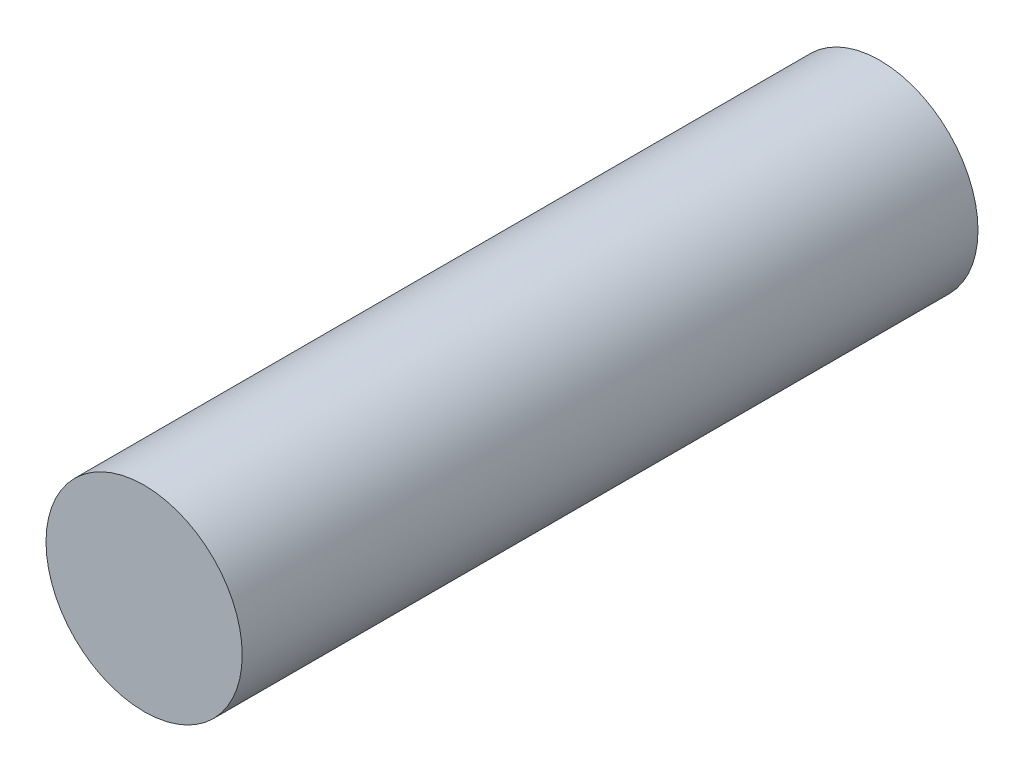
ISO-10303-21;
HEADER;
FILE_DESCRIPTION(('STEP AP214'),'2;1');
FILE_NAME('part.step','',(''),(''),'','','');
FILE_SCHEMA(('AUTOMOTIVE_DESIGN { 1 0 10303 214 1 1 1 1 }'));
ENDSEC;
DATA;
#1=APPLICATION_CONTEXT('core data for automotive mechanical design processes');
#2=APPLICATION_PROTOCOL_DEFINITION('international standard','automotive_design',2000,#1);
#3=PRODUCT_CONTEXT('',#1,'mechanical');
#4=PRODUCT('Part','Part','',(#3));
#5=PRODUCT_RELATED_PRODUCT_CATEGORY('part','',(#4));
#6=PRODUCT_DEFINITION_FORMATION('','',#4);
#7=PRODUCT_DEFINITION_CONTEXT('part definition',#1,'design');
#8=PRODUCT_DEFINITION('design','',#6,#7);
#9=PRODUCT_DEFINITION_SHAPE('','',#8);
#10=(LENGTH_UNIT() NAMED_UNIT(*) SI_UNIT(.MILLI.,.METRE.));
#11=(NAMED_UNIT(*) PLANE_ANGLE_UNIT() SI_UNIT($,.RADIAN.));
#12=(NAMED_UNIT(*) SI_UNIT($,.STERADIAN.) SOLID_ANGLE_UNIT());
#13=UNCERTAINTY_MEASURE_WITH_UNIT(LENGTH_MEASURE(1.E-05),#10,'distance_accuracy_value','');
#14=(GEOMETRIC_REPRESENTATION_CONTEXT(3) GLOBAL_UNCERTAINTY_ASSIGNED_CONTEXT((#13)) GLOBAL_UNIT_ASSIGNED_CONTEXT((#10,
#11,#12)) REPRESENTATION_CONTEXT('',''));
#15=CARTESIAN_POINT('',(0.,0.,0.));
#16=DIRECTION('',(0.,0.,1.));
#17=DIRECTION('',(1.,0.,0.));
#18=AXIS2_PLACEMENT_3D('',#15,#16,#17);
#19=CARTESIAN_POINT('',(0.,0.,300.));
#20=DIRECTION('',(0.,0.,-1.));
#21=DIRECTION('',(-1.,0.,0.));
#22=AXIS2_PLACEMENT_3D('',#19,#20,#21);
#23=CYLINDRICAL_SURFACE('',#22,40.);
#24=CARTESIAN_POINT('',(0.,0.,300.));
#25=DIRECTION('',(0.,0.,1.));
#26=DIRECTION('',(1.,0.,0.));
#27=AXIS2_PLACEMENT_3D('',#24,#25,#26);
#28=CIRCLE('',#27,40.);
#29=CARTESIAN_POINT('',(40.,0.,300.));
#30=VERTEX_POINT('',#29);
#31=EDGE_CURVE('E10',#30,#30,#28,.T.);
#32=ORIENTED_EDGE('',*,*,#31,.F.);
#33=EDGE_LOOP('',(#32));
#34=FACE_BOUND('',#33,.T.);
#35=CARTESIAN_POINT('',(0.,0.,0.));
#36=DIRECTION('',(0.,0.,1.));
#37=DIRECTION('',(1.,0.,0.));
#38=AXIS2_PLACEMENT_3D('',#35,#36,#37);
#39=CIRCLE('',#38,40.);
#40=CARTESIAN_POINT('',(40.,0.,0.));
#41=VERTEX_POINT('',#40);
#42=EDGE_CURVE('E44',#41,#41,#39,.T.);
#43=ORIENTED_EDGE('',*,*,#42,.T.);
#44=EDGE_LOOP('',(#43));
#45=FACE_BOUND('',#44,.T.);
#46=ADVANCED_FACE('F41',(#34,#45),#23,.T.);
#47=CARTESIAN_POINT('',(0.,0.,300.));
#48=DIRECTION('',(0.,0.,1.));
#49=DIRECTION('',(1.,0.,0.));
#50=AXIS2_PLACEMENT_3D('',#47,#48,#49);
#51=PLANE('',#50);
#52=ORIENTED_EDGE('',*,*,#31,.T.);
#53=EDGE_LOOP('',(#52));
#54=FACE_BOUND('',#53,.T.);
#55=ADVANCED_FACE('F58',(#54),#51,.T.);
#56=CARTESIAN_POINT('',(0.,0.,0.));
#57=DIRECTION('',(0.,0.,1.));
#58=DIRECTION('',(1.,0.,0.));
#59=AXIS2_PLACEMENT_3D('',#56,#57,#58);
#60=PLANE('',#59);
#61=ORIENTED_EDGE('',*,*,#42,.F.);
#62=EDGE_LOOP('',(#61));
#63=FACE_BOUND('',#62,.T.);
#64=ADVANCED_FACE('F56',(#63),#60,.F.);
#65=CLOSED_SHELL('',(#46,#55,#64));
#66=MANIFOLD_SOLID_BREP('B2',#65);
#67=ADVANCED_BREP_SHAPE_REPRESENTATION('',(#18,#66),#14);
#68=SHAPE_DEFINITION_REPRESENTATION(#9,#67);
ENDSEC;
END-ISO-10303-21;
